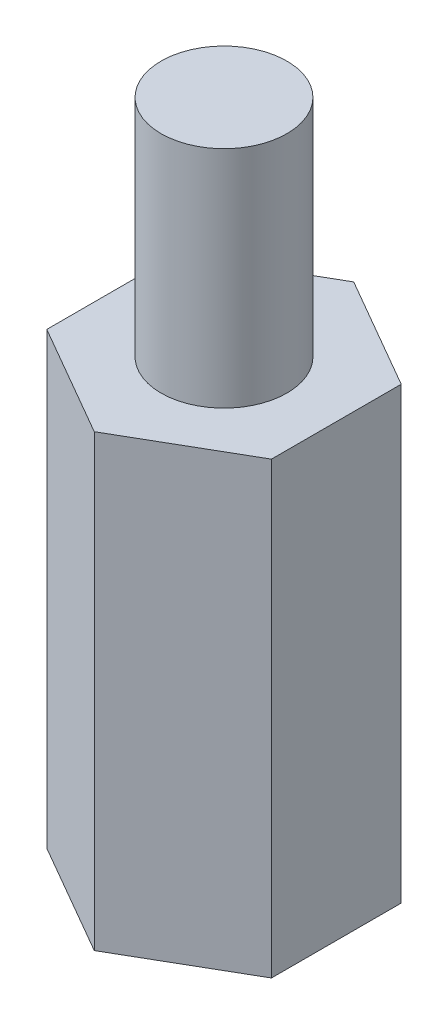
ISO-10303-21;
HEADER;
FILE_DESCRIPTION(('STEP AP214'),'2;1');
FILE_NAME('part.step','',(''),(''),'','','');
FILE_SCHEMA(('AUTOMOTIVE_DESIGN { 1 0 10303 214 1 1 1 1 }'));
ENDSEC;
DATA;
#1=APPLICATION_CONTEXT('core data for automotive mechanical design processes');
#2=APPLICATION_PROTOCOL_DEFINITION('international standard','automotive_design',2000,#1);
#3=PRODUCT_CONTEXT('',#1,'mechanical');
#4=PRODUCT('Part','Part','',(#3));
#5=PRODUCT_RELATED_PRODUCT_CATEGORY('part','',(#4));
#6=PRODUCT_DEFINITION_FORMATION('','',#4);
#7=PRODUCT_DEFINITION_CONTEXT('part definition',#1,'design');
#8=PRODUCT_DEFINITION('design','',#6,#7);
#9=PRODUCT_DEFINITION_SHAPE('','',#8);
#10=(LENGTH_UNIT() NAMED_UNIT(*) SI_UNIT(.MILLI.,.METRE.));
#11=(NAMED_UNIT(*) PLANE_ANGLE_UNIT() SI_UNIT($,.RADIAN.));
#12=(NAMED_UNIT(*) SI_UNIT($,.STERADIAN.) SOLID_ANGLE_UNIT());
#13=UNCERTAINTY_MEASURE_WITH_UNIT(LENGTH_MEASURE(1.E-05),#10,'distance_accuracy_value','');
#14=(GEOMETRIC_REPRESENTATION_CONTEXT(3) GLOBAL_UNCERTAINTY_ASSIGNED_CONTEXT((#13)) GLOBAL_UNIT_ASSIGNED_CONTEXT((#10,
#11,#12)) REPRESENTATION_CONTEXT('',''));
#15=CARTESIAN_POINT('',(0.,0.,0.));
#16=DIRECTION('',(0.,0.,1.));
#17=DIRECTION('',(1.,0.,0.));
#18=AXIS2_PLACEMENT_3D('',#15,#16,#17);
#19=CARTESIAN_POINT('',(3.17499999999998,12.7,-1.8330871046771));
#20=DIRECTION('',(-0.499999999999995,0.,0.866025403784442));
#21=DIRECTION('',(0.866025403784442,0.,0.499999999999995));
#22=AXIS2_PLACEMENT_3D('',#19,#20,#21);
#23=PLANE('',#22);
#24=DIRECTION('',(-0.866025403784442,0.,-0.499999999999995));
#25=VECTOR('',#24,1.);
#26=CARTESIAN_POINT('',(3.17499999999998,0.,-1.8330871046771));
#27=LINE('',#26,#25);
#28=CARTESIAN_POINT('',(3.17499999999998,0.,-1.8330871046771));
#29=VERTEX_POINT('',#28);
#30=CARTESIAN_POINT('',(0.,0.,-3.66617420935413));
#31=VERTEX_POINT('',#30);
#32=EDGE_CURVE('E117',#29,#31,#27,.T.);
#33=ORIENTED_EDGE('',*,*,#32,.T.);
#34=DIRECTION('',(0.,-1.,0.));
#35=VECTOR('',#34,1.);
#36=CARTESIAN_POINT('',(0.,12.7,-3.66617420935413));
#37=LINE('',#36,#35);
#38=CARTESIAN_POINT('',(0.,12.7,-3.66617420935413));
#39=VERTEX_POINT('',#38);
#40=EDGE_CURVE('E11',#39,#31,#37,.T.);
#41=ORIENTED_EDGE('',*,*,#40,.F.);
#42=DIRECTION('',(-0.866025403784442,0.,-0.499999999999995));
#43=VECTOR('',#42,1.);
#44=CARTESIAN_POINT('',(3.17499999999998,12.7,-1.8330871046771));
#45=LINE('',#44,#43);
#46=CARTESIAN_POINT('',(3.17499999999998,12.7,-1.8330871046771));
#47=VERTEX_POINT('',#46);
#48=EDGE_CURVE('E128',#47,#39,#45,.T.);
#49=ORIENTED_EDGE('',*,*,#48,.F.);
#50=DIRECTION('',(0.,-1.,0.));
#51=VECTOR('',#50,1.);
#52=CARTESIAN_POINT('',(3.17499999999998,12.7,-1.8330871046771));
#53=LINE('',#52,#51);
#54=EDGE_CURVE('E113',#47,#29,#53,.T.);
#55=ORIENTED_EDGE('',*,*,#54,.T.);
#56=EDGE_LOOP('',(#33,#41,#49,#55));
#57=FACE_BOUND('',#56,.T.);
#58=ADVANCED_FACE('F33',(#57),#23,.F.);
#59=CARTESIAN_POINT('',(0.,12.7,-3.66617420935413));
#60=DIRECTION('',(0.500000000000001,0.,0.866025403784438));
#61=DIRECTION('',(0.866025403784438,0.,-0.500000000000001));
#62=AXIS2_PLACEMENT_3D('',#59,#60,#61);
#63=PLANE('',#62);
#64=DIRECTION('',(-0.866025403784438,0.,0.500000000000001));
#65=VECTOR('',#64,1.);
#66=CARTESIAN_POINT('',(0.,0.,-3.66617420935413));
#67=LINE('',#66,#65);
#68=CARTESIAN_POINT('',(-3.17500000000001,0.,-1.83308710467706));
#69=VERTEX_POINT('',#68);
#70=EDGE_CURVE('E120',#31,#69,#67,.T.);
#71=ORIENTED_EDGE('',*,*,#70,.T.);
#72=DIRECTION('',(0.,-1.,0.));
#73=VECTOR('',#72,1.);
#74=CARTESIAN_POINT('',(-3.17500000000001,12.7,-1.83308710467706));
#75=LINE('',#74,#73);
#76=CARTESIAN_POINT('',(-3.17500000000001,12.7,-1.83308710467706));
#77=VERTEX_POINT('',#76);
#78=EDGE_CURVE('E41',#77,#69,#75,.T.);
#79=ORIENTED_EDGE('',*,*,#78,.F.);
#80=DIRECTION('',(-0.866025403784438,0.,0.500000000000001));
#81=VECTOR('',#80,1.);
#82=CARTESIAN_POINT('',(0.,12.7,-3.66617420935413));
#83=LINE('',#82,#81);
#84=EDGE_CURVE('E86',#39,#77,#83,.T.);
#85=ORIENTED_EDGE('',*,*,#84,.F.);
#86=ORIENTED_EDGE('',*,*,#40,.T.);
#87=EDGE_LOOP('',(#71,#79,#85,#86));
#88=FACE_BOUND('',#87,.T.);
#89=ADVANCED_FACE('F153',(#88),#63,.F.);
#90=CARTESIAN_POINT('',(-3.17500000000001,12.7,-1.83308710467706));
#91=DIRECTION('',(1.,0.,0.));
#92=DIRECTION('',(0.,0.,-1.));
#93=AXIS2_PLACEMENT_3D('',#90,#91,#92);
#94=PLANE('',#93);
#95=DIRECTION('',(0.,0.,1.));
#96=VECTOR('',#95,1.);
#97=CARTESIAN_POINT('',(-3.17500000000001,0.,-1.83308710467706));
#98=LINE('',#97,#96);
#99=CARTESIAN_POINT('',(-3.17499999999999,0.,1.83308710467708));
#100=VERTEX_POINT('',#99);
#101=EDGE_CURVE('E123',#69,#100,#98,.T.);
#102=ORIENTED_EDGE('',*,*,#101,.T.);
#103=DIRECTION('',(0.,-1.,0.));
#104=VECTOR('',#103,1.);
#105=CARTESIAN_POINT('',(-3.17499999999999,12.7,1.83308710467708));
#106=LINE('',#105,#104);
#107=CARTESIAN_POINT('',(-3.17499999999999,12.7,1.83308710467708));
#108=VERTEX_POINT('',#107);
#109=EDGE_CURVE('E108',#108,#100,#106,.T.);
#110=ORIENTED_EDGE('',*,*,#109,.F.);
#111=DIRECTION('',(0.,0.,1.));
#112=VECTOR('',#111,1.);
#113=CARTESIAN_POINT('',(-3.17500000000001,12.7,-1.83308710467706));
#114=LINE('',#113,#112);
#115=EDGE_CURVE('E99',#77,#108,#114,.T.);
#116=ORIENTED_EDGE('',*,*,#115,.F.);
#117=ORIENTED_EDGE('',*,*,#78,.T.);
#118=EDGE_LOOP('',(#102,#110,#116,#117));
#119=FACE_BOUND('',#118,.T.);
#120=ADVANCED_FACE('F134',(#119),#94,.F.);
#121=CARTESIAN_POINT('',(-3.17499999999999,12.7,1.83308710467708));
#122=DIRECTION('',(0.499999999999995,0.,-0.866025403784441));
#123=DIRECTION('',(-0.866025403784442,0.,-0.499999999999995));
#124=AXIS2_PLACEMENT_3D('',#121,#122,#123);
#125=PLANE('',#124);
#126=DIRECTION('',(0.866025403784441,0.,0.499999999999995));
#127=VECTOR('',#126,1.);
#128=CARTESIAN_POINT('',(-3.17499999999999,0.,1.83308710467708));
#129=LINE('',#128,#127);
#130=CARTESIAN_POINT('',(0.,0.,3.66617420935413));
#131=VERTEX_POINT('',#130);
#132=EDGE_CURVE('E107',#100,#131,#129,.T.);
#133=ORIENTED_EDGE('',*,*,#132,.T.);
#134=DIRECTION('',(0.,-1.,0.));
#135=VECTOR('',#134,1.);
#136=CARTESIAN_POINT('',(0.,12.7,3.66617420935413));
#137=LINE('',#136,#135);
#138=CARTESIAN_POINT('',(0.,12.7,3.66617420935413));
#139=VERTEX_POINT('',#138);
#140=EDGE_CURVE('E104',#139,#131,#137,.T.);
#141=ORIENTED_EDGE('',*,*,#140,.F.);
#142=DIRECTION('',(0.866025403784441,0.,0.499999999999995));
#143=VECTOR('',#142,1.);
#144=CARTESIAN_POINT('',(-3.17499999999999,12.7,1.83308710467708));
#145=LINE('',#144,#143);
#146=EDGE_CURVE('E93',#108,#139,#145,.T.);
#147=ORIENTED_EDGE('',*,*,#146,.F.);
#148=ORIENTED_EDGE('',*,*,#109,.T.);
#149=EDGE_LOOP('',(#133,#141,#147,#148));
#150=FACE_BOUND('',#149,.T.);
#151=ADVANCED_FACE('F105',(#150),#125,.F.);
#152=CARTESIAN_POINT('',(0.,12.7,3.66617420935413));
#153=DIRECTION('',(-0.500000000000007,0.,-0.866025403784435));
#154=DIRECTION('',(-0.866025403784435,0.,0.500000000000007));
#155=AXIS2_PLACEMENT_3D('',#152,#153,#154);
#156=PLANE('',#155);
#157=DIRECTION('',(0.866025403784435,0.,-0.500000000000007));
#158=VECTOR('',#157,1.);
#159=CARTESIAN_POINT('',(0.,0.,3.66617420935413));
#160=LINE('',#159,#158);
#161=CARTESIAN_POINT('',(3.17500000000002,0.,1.83308710467703));
#162=VERTEX_POINT('',#161);
#163=EDGE_CURVE('E72',#131,#162,#160,.T.);
#164=ORIENTED_EDGE('',*,*,#163,.T.);
#165=DIRECTION('',(0.,-1.,0.));
#166=VECTOR('',#165,1.);
#167=CARTESIAN_POINT('',(3.17500000000002,12.7,1.83308710467703));
#168=LINE('',#167,#166);
#169=CARTESIAN_POINT('',(3.17500000000002,12.7,1.83308710467703));
#170=VERTEX_POINT('',#169);
#171=EDGE_CURVE('E109',#170,#162,#168,.T.);
#172=ORIENTED_EDGE('',*,*,#171,.F.);
#173=DIRECTION('',(0.866025403784435,0.,-0.500000000000007));
#174=VECTOR('',#173,1.);
#175=CARTESIAN_POINT('',(0.,12.7,3.66617420935413));
#176=LINE('',#175,#174);
#177=EDGE_CURVE('E97',#139,#170,#176,.T.);
#178=ORIENTED_EDGE('',*,*,#177,.F.);
#179=ORIENTED_EDGE('',*,*,#140,.T.);
#180=EDGE_LOOP('',(#164,#172,#178,#179));
#181=FACE_BOUND('',#180,.T.);
#182=ADVANCED_FACE('F111',(#181),#156,.F.);
#183=CARTESIAN_POINT('',(3.17500000000002,12.7,1.83308710467703));
#184=DIRECTION('',(-1.,0.,0.));
#185=DIRECTION('',(0.,0.,1.));
#186=AXIS2_PLACEMENT_3D('',#183,#184,#185);
#187=PLANE('',#186);
#188=DIRECTION('',(0.,0.,-1.));
#189=VECTOR('',#188,1.);
#190=CARTESIAN_POINT('',(3.17500000000002,0.,1.83308710467703));
#191=LINE('',#190,#189);
#192=EDGE_CURVE('E78',#162,#29,#191,.T.);
#193=ORIENTED_EDGE('',*,*,#192,.T.);
#194=ORIENTED_EDGE('',*,*,#54,.F.);
#195=DIRECTION('',(0.,0.,-1.));
#196=VECTOR('',#195,1.);
#197=CARTESIAN_POINT('',(3.17500000000002,12.7,1.83308710467703));
#198=LINE('',#197,#196);
#199=EDGE_CURVE('E49',#170,#47,#198,.T.);
#200=ORIENTED_EDGE('',*,*,#199,.F.);
#201=ORIENTED_EDGE('',*,*,#171,.T.);
#202=EDGE_LOOP('',(#193,#194,#200,#201));
#203=FACE_BOUND('',#202,.T.);
#204=ADVANCED_FACE('F141',(#203),#187,.F.);
#205=CARTESIAN_POINT('',(0.,12.7,0.));
#206=DIRECTION('',(0.,1.,0.));
#207=DIRECTION('',(0.,0.,1.));
#208=AXIS2_PLACEMENT_3D('',#205,#206,#207);
#209=PLANE('',#208);
#210=CARTESIAN_POINT('',(0.,12.7,0.));
#211=DIRECTION('',(0.,1.,0.));
#212=DIRECTION('',(0.,0.,1.));
#213=AXIS2_PLACEMENT_3D('',#210,#211,#212);
#214=CIRCLE('',#213,1.778);
#215=CARTESIAN_POINT('',(0.,12.7,1.778));
#216=VERTEX_POINT('',#215);
#217=EDGE_CURVE('E214',#216,#216,#214,.T.);
#218=ORIENTED_EDGE('',*,*,#217,.F.);
#219=EDGE_LOOP('',(#218));
#220=FACE_BOUND('',#219,.T.);
#221=ORIENTED_EDGE('',*,*,#48,.T.);
#222=ORIENTED_EDGE('',*,*,#84,.T.);
#223=ORIENTED_EDGE('',*,*,#115,.T.);
#224=ORIENTED_EDGE('',*,*,#146,.T.);
#225=ORIENTED_EDGE('',*,*,#177,.T.);
#226=ORIENTED_EDGE('',*,*,#199,.T.);
#227=EDGE_LOOP('',(#221,#222,#223,#224,#225,#226));
#228=FACE_BOUND('',#227,.T.);
#229=ADVANCED_FACE('F95',(#220,#228),#209,.T.);
#230=CARTESIAN_POINT('',(0.,0.,0.));
#231=DIRECTION('',(0.,1.,0.));
#232=DIRECTION('',(0.,0.,1.));
#233=AXIS2_PLACEMENT_3D('',#230,#231,#232);
#234=PLANE('',#233);
#235=ORIENTED_EDGE('',*,*,#32,.F.);
#236=ORIENTED_EDGE('',*,*,#192,.F.);
#237=ORIENTED_EDGE('',*,*,#163,.F.);
#238=ORIENTED_EDGE('',*,*,#132,.F.);
#239=ORIENTED_EDGE('',*,*,#101,.F.);
#240=ORIENTED_EDGE('',*,*,#70,.F.);
#241=EDGE_LOOP('',(#235,#236,#237,#238,#239,#240));
#242=FACE_BOUND('',#241,.T.);
#243=ADVANCED_FACE('F137',(#242),#234,.F.);
#244=CARTESIAN_POINT('',(0.,19.05,0.));
#245=DIRECTION('',(0.,-1.,0.));
#246=DIRECTION('',(0.,0.,-1.));
#247=AXIS2_PLACEMENT_3D('',#244,#245,#246);
#248=CYLINDRICAL_SURFACE('',#247,1.778);
#249=CARTESIAN_POINT('',(0.,19.05,0.));
#250=DIRECTION('',(0.,1.,0.));
#251=DIRECTION('',(0.,0.,1.));
#252=AXIS2_PLACEMENT_3D('',#249,#250,#251);
#253=CIRCLE('',#252,1.778);
#254=CARTESIAN_POINT('',(0.,19.05,1.778));
#255=VERTEX_POINT('',#254);
#256=EDGE_CURVE('E121',#255,#255,#253,.T.);
#257=ORIENTED_EDGE('',*,*,#256,.F.);
#258=EDGE_LOOP('',(#257));
#259=FACE_BOUND('',#258,.T.);
#260=ORIENTED_EDGE('',*,*,#217,.T.);
#261=EDGE_LOOP('',(#260));
#262=FACE_BOUND('',#261,.T.);
#263=ADVANCED_FACE('F185',(#259,#262),#248,.T.);
#264=CARTESIAN_POINT('',(0.,19.05,0.));
#265=DIRECTION('',(0.,1.,0.));
#266=DIRECTION('',(0.,0.,1.));
#267=AXIS2_PLACEMENT_3D('',#264,#265,#266);
#268=PLANE('',#267);
#269=ORIENTED_EDGE('',*,*,#256,.T.);
#270=EDGE_LOOP('',(#269));
#271=FACE_BOUND('',#270,.T.);
#272=ADVANCED_FACE('F198',(#271),#268,.T.);
#273=CLOSED_SHELL('',(#58,#89,#120,#151,#182,#204,#229,#243,#263,#272));
#274=MANIFOLD_SOLID_BREP('B2',#273);
#275=ADVANCED_BREP_SHAPE_REPRESENTATION('',(#18,#274),#14);
#276=SHAPE_DEFINITION_REPRESENTATION(#9,#275);
ENDSEC;
END-ISO-10303-21;
